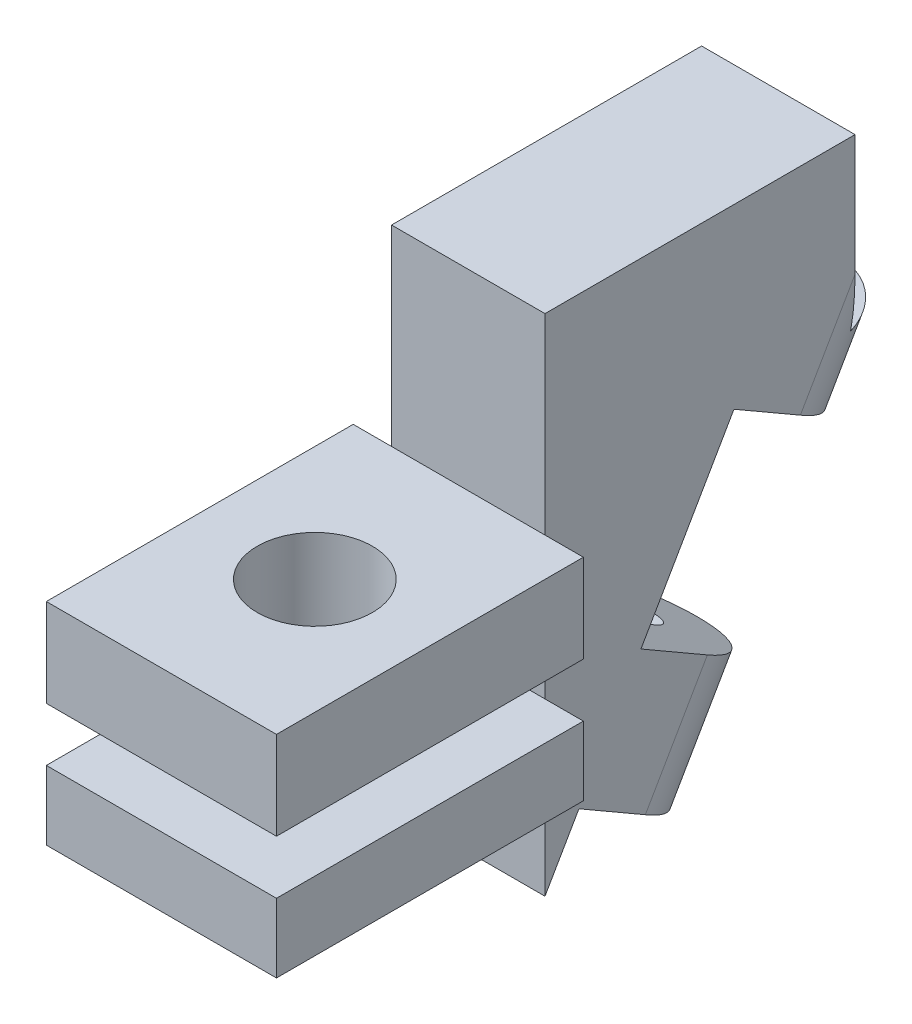
ISO-10303-21;
HEADER;
FILE_DESCRIPTION(('STEP AP214'),'2;1');
FILE_NAME('part.step','',(''),(''),'','','');
FILE_SCHEMA(('AUTOMOTIVE_DESIGN { 1 0 10303 214 1 1 1 1 }'));
ENDSEC;
DATA;
#1=APPLICATION_CONTEXT('core data for automotive mechanical design processes');
#2=APPLICATION_PROTOCOL_DEFINITION('international standard','automotive_design',2000,#1);
#3=PRODUCT_CONTEXT('',#1,'mechanical');
#4=PRODUCT('Part','Part','',(#3));
#5=PRODUCT_RELATED_PRODUCT_CATEGORY('part','',(#4));
#6=PRODUCT_DEFINITION_FORMATION('','',#4);
#7=PRODUCT_DEFINITION_CONTEXT('part definition',#1,'design');
#8=PRODUCT_DEFINITION('design','',#6,#7);
#9=PRODUCT_DEFINITION_SHAPE('','',#8);
#10=(LENGTH_UNIT() NAMED_UNIT(*) SI_UNIT(.MILLI.,.METRE.));
#11=(NAMED_UNIT(*) PLANE_ANGLE_UNIT() SI_UNIT($,.RADIAN.));
#12=(NAMED_UNIT(*) SI_UNIT($,.STERADIAN.) SOLID_ANGLE_UNIT());
#13=UNCERTAINTY_MEASURE_WITH_UNIT(LENGTH_MEASURE(1.E-05),#10,'distance_accuracy_value','');
#14=(GEOMETRIC_REPRESENTATION_CONTEXT(3) GLOBAL_UNCERTAINTY_ASSIGNED_CONTEXT((#13)) GLOBAL_UNIT_ASSIGNED_CONTEXT((#10,
#11,#12)) REPRESENTATION_CONTEXT('',''));
#15=CARTESIAN_POINT('',(0.,0.,0.));
#16=DIRECTION('',(0.,0.,1.));
#17=DIRECTION('',(1.,0.,0.));
#18=AXIS2_PLACEMENT_3D('',#15,#16,#17);
#19=CARTESIAN_POINT('',(3.,-1.,19.0829037686548));
#20=DIRECTION('',(0.,0.,-1.));
#21=DIRECTION('',(-1.,0.,0.));
#22=AXIS2_PLACEMENT_3D('',#19,#20,#21);
#23=PLANE('',#22);
#24=DIRECTION('',(0.,1.,0.));
#25=VECTOR('',#24,1.);
#26=CARTESIAN_POINT('',(-3.,-1.,19.0829037686548));
#27=LINE('',#26,#25);
#28=CARTESIAN_POINT('',(-3.,-1.,19.0829037686548));
#29=VERTEX_POINT('',#28);
#30=CARTESIAN_POINT('',(-3.,0.8,19.0829037686548));
#31=VERTEX_POINT('',#30);
#32=EDGE_CURVE('E318',#29,#31,#27,.T.);
#33=ORIENTED_EDGE('',*,*,#32,.T.);
#34=DIRECTION('',(-1.,0.,0.));
#35=VECTOR('',#34,1.);
#36=CARTESIAN_POINT('',(-3.,0.8,19.0829037686548));
#37=LINE('',#36,#35);
#38=CARTESIAN_POINT('',(-2.,0.8,19.0829037686548));
#39=VERTEX_POINT('',#38);
#40=EDGE_CURVE('E257',#39,#31,#37,.T.);
#41=ORIENTED_EDGE('',*,*,#40,.F.);
#42=DIRECTION('',(0.,1.,0.));
#43=VECTOR('',#42,1.);
#44=CARTESIAN_POINT('',(-2.,9.5,19.0829037686548));
#45=LINE('',#44,#43);
#46=CARTESIAN_POINT('',(-2.,-1.,19.0829037686548));
#47=VERTEX_POINT('',#46);
#48=EDGE_CURVE('E345',#47,#39,#45,.T.);
#49=ORIENTED_EDGE('',*,*,#48,.F.);
#50=DIRECTION('',(-1.,0.,0.));
#51=VECTOR('',#50,1.);
#52=CARTESIAN_POINT('',(3.,-1.,19.0829037686548));
#53=LINE('',#52,#51);
#54=EDGE_CURVE('E312',#47,#29,#53,.T.);
#55=ORIENTED_EDGE('',*,*,#54,.T.);
#56=EDGE_LOOP('',(#33,#41,#49,#55));
#57=FACE_BOUND('',#56,.T.);
#58=ADVANCED_FACE('F35',(#57),#23,.T.);
#59=DIRECTION('',(0.,-1.,0.));
#60=VECTOR('',#59,1.);
#61=CARTESIAN_POINT('',(2.,9.5,19.0829037686548));
#62=LINE('',#61,#60);
#63=CARTESIAN_POINT('',(2.,0.8,19.0829037686548));
#64=VERTEX_POINT('',#63);
#65=CARTESIAN_POINT('',(2.,-1.,19.0829037686548));
#66=VERTEX_POINT('',#65);
#67=EDGE_CURVE('E354',#64,#66,#62,.T.);
#68=ORIENTED_EDGE('',*,*,#67,.F.);
#69=CARTESIAN_POINT('',(3.,0.8,19.0829037686548));
#70=VERTEX_POINT('',#69);
#71=EDGE_CURVE('E258',#70,#64,#37,.T.);
#72=ORIENTED_EDGE('',*,*,#71,.F.);
#73=DIRECTION('',(0.,1.,0.));
#74=VECTOR('',#73,1.);
#75=CARTESIAN_POINT('',(3.,-1.,19.0829037686548));
#76=LINE('',#75,#74);
#77=CARTESIAN_POINT('',(3.,-1.,19.0829037686548));
#78=VERTEX_POINT('',#77);
#79=EDGE_CURVE('E323',#78,#70,#76,.T.);
#80=ORIENTED_EDGE('',*,*,#79,.F.);
#81=EDGE_CURVE('E313',#78,#66,#53,.T.);
#82=ORIENTED_EDGE('',*,*,#81,.T.);
#83=EDGE_LOOP('',(#68,#72,#80,#82));
#84=FACE_BOUND('',#83,.T.);
#85=ADVANCED_FACE('F457',(#84),#23,.T.);
#86=CARTESIAN_POINT('',(-3.,-1.,27.0829037686548));
#87=DIRECTION('',(-1.,0.,0.));
#88=DIRECTION('',(0.,0.,1.));
#89=AXIS2_PLACEMENT_3D('',#86,#87,#88);
#90=PLANE('',#89);
#91=DIRECTION('',(0.,1.,0.));
#92=VECTOR('',#91,1.);
#93=CARTESIAN_POINT('',(-3.,-1.,27.0829037686548));
#94=LINE('',#93,#92);
#95=CARTESIAN_POINT('',(-3.,-1.,27.0829037686548));
#96=VERTEX_POINT('',#95);
#97=CARTESIAN_POINT('',(-3.,0.8,27.0829037686548));
#98=VERTEX_POINT('',#97);
#99=EDGE_CURVE('E331',#96,#98,#94,.T.);
#100=ORIENTED_EDGE('',*,*,#99,.T.);
#101=DIRECTION('',(0.,0.,1.));
#102=VECTOR('',#101,1.);
#103=CARTESIAN_POINT('',(-3.,0.8,19.0829037686548));
#104=LINE('',#103,#102);
#105=EDGE_CURVE('E225',#31,#98,#104,.T.);
#106=ORIENTED_EDGE('',*,*,#105,.F.);
#107=ORIENTED_EDGE('',*,*,#32,.F.);
#108=DIRECTION('',(0.,0.,1.));
#109=VECTOR('',#108,1.);
#110=CARTESIAN_POINT('',(-3.,-1.,27.0829037686548));
#111=LINE('',#110,#109);
#112=EDGE_CURVE('E302',#29,#96,#111,.T.);
#113=ORIENTED_EDGE('',*,*,#112,.T.);
#114=EDGE_LOOP('',(#100,#106,#107,#113));
#115=FACE_BOUND('',#114,.T.);
#116=ADVANCED_FACE('F441',(#115),#90,.T.);
#117=CARTESIAN_POINT('',(3.,-1.,27.0829037686548));
#118=DIRECTION('',(1.,0.,0.));
#119=DIRECTION('',(0.,0.,-1.));
#120=AXIS2_PLACEMENT_3D('',#117,#118,#119);
#121=PLANE('',#120);
#122=ORIENTED_EDGE('',*,*,#79,.T.);
#123=DIRECTION('',(0.,0.,-1.));
#124=VECTOR('',#123,1.);
#125=CARTESIAN_POINT('',(3.,0.8,27.0829037686548));
#126=LINE('',#125,#124);
#127=CARTESIAN_POINT('',(3.,0.8,27.0829037686548));
#128=VERTEX_POINT('',#127);
#129=EDGE_CURVE('E255',#128,#70,#126,.T.);
#130=ORIENTED_EDGE('',*,*,#129,.F.);
#131=DIRECTION('',(0.,1.,0.));
#132=VECTOR('',#131,1.);
#133=CARTESIAN_POINT('',(3.,-1.,27.0829037686548));
#134=LINE('',#133,#132);
#135=CARTESIAN_POINT('',(3.,-1.,27.0829037686548));
#136=VERTEX_POINT('',#135);
#137=EDGE_CURVE('E327',#136,#128,#134,.T.);
#138=ORIENTED_EDGE('',*,*,#137,.F.);
#139=DIRECTION('',(0.,0.,-1.));
#140=VECTOR('',#139,1.);
#141=CARTESIAN_POINT('',(3.,-1.,27.0829037686548));
#142=LINE('',#141,#140);
#143=EDGE_CURVE('E309',#136,#78,#142,.T.);
#144=ORIENTED_EDGE('',*,*,#143,.T.);
#145=EDGE_LOOP('',(#122,#130,#138,#144));
#146=FACE_BOUND('',#145,.T.);
#147=ADVANCED_FACE('F454',(#146),#121,.T.);
#148=CARTESIAN_POINT('',(3.,-1.,27.0829037686548));
#149=DIRECTION('',(0.,0.,1.));
#150=DIRECTION('',(1.,0.,0.));
#151=AXIS2_PLACEMENT_3D('',#148,#149,#150);
#152=PLANE('',#151);
#153=ORIENTED_EDGE('',*,*,#137,.T.);
#154=DIRECTION('',(1.,0.,0.));
#155=VECTOR('',#154,1.);
#156=CARTESIAN_POINT('',(-3.,0.8,27.0829037686548));
#157=LINE('',#156,#155);
#158=EDGE_CURVE('E253',#98,#128,#157,.T.);
#159=ORIENTED_EDGE('',*,*,#158,.F.);
#160=ORIENTED_EDGE('',*,*,#99,.F.);
#161=DIRECTION('',(1.,0.,0.));
#162=VECTOR('',#161,1.);
#163=CARTESIAN_POINT('',(3.,-1.,27.0829037686548));
#164=LINE('',#163,#162);
#165=EDGE_CURVE('E306',#96,#136,#164,.T.);
#166=ORIENTED_EDGE('',*,*,#165,.T.);
#167=EDGE_LOOP('',(#153,#159,#160,#166));
#168=FACE_BOUND('',#167,.T.);
#169=ADVANCED_FACE('F446',(#168),#152,.T.);
#170=CARTESIAN_POINT('',(0.,-6.5,23.0829037686548));
#171=DIRECTION('',(0.,1.,0.));
#172=DIRECTION('',(0.,0.,1.));
#173=AXIS2_PLACEMENT_3D('',#170,#171,#172);
#174=CYLINDRICAL_SURFACE('',#173,1.5);
#175=CARTESIAN_POINT('',(0.,-1.,23.0829037686548));
#176=DIRECTION('',(0.,1.,0.));
#177=DIRECTION('',(0.,0.,1.));
#178=AXIS2_PLACEMENT_3D('',#175,#176,#177);
#179=CIRCLE('',#178,1.5);
#180=CARTESIAN_POINT('',(0.,-1.,24.5829037686548));
#181=VERTEX_POINT('',#180);
#182=EDGE_CURVE('E286',#181,#181,#179,.T.);
#183=ORIENTED_EDGE('',*,*,#182,.F.);
#184=EDGE_LOOP('',(#183));
#185=FACE_BOUND('',#184,.T.);
#186=CARTESIAN_POINT('',(0.,0.8,23.0829037686548));
#187=DIRECTION('',(0.,1.,0.));
#188=DIRECTION('',(0.,0.,1.));
#189=AXIS2_PLACEMENT_3D('',#186,#187,#188);
#190=CIRCLE('',#189,1.5);
#191=CARTESIAN_POINT('',(0.,0.8,24.5829037686548));
#192=VERTEX_POINT('',#191);
#193=EDGE_CURVE('E275',#192,#192,#190,.F.);
#194=ORIENTED_EDGE('',*,*,#193,.F.);
#195=EDGE_LOOP('',(#194));
#196=FACE_BOUND('',#195,.T.);
#197=ADVANCED_FACE('F528',(#185,#196),#174,.F.);
#198=CARTESIAN_POINT('',(19.925772879665,9.5,19.0829037686548));
#199=DIRECTION('',(0.,0.,-1.));
#200=DIRECTION('',(-1.,0.,0.));
#201=AXIS2_PLACEMENT_3D('',#198,#199,#200);
#202=PLANE('',#201);
#203=DIRECTION('',(-1.,0.,0.));
#204=VECTOR('',#203,1.);
#205=CARTESIAN_POINT('',(3.,4.5,19.0829037686548));
#206=LINE('',#205,#204);
#207=CARTESIAN_POINT('',(2.,4.5,19.0829037686548));
#208=VERTEX_POINT('',#207);
#209=CARTESIAN_POINT('',(-2.,4.5,19.0829037686548));
#210=VERTEX_POINT('',#209);
#211=EDGE_CURVE('E303',#208,#210,#206,.T.);
#212=ORIENTED_EDGE('',*,*,#211,.F.);
#213=CARTESIAN_POINT('',(2.,9.5,19.0829037686548));
#214=VERTEX_POINT('',#213);
#215=EDGE_CURVE('E350',#214,#208,#62,.T.);
#216=ORIENTED_EDGE('',*,*,#215,.F.);
#217=DIRECTION('',(-1.,0.,0.));
#218=VECTOR('',#217,1.);
#219=CARTESIAN_POINT('',(19.925772879665,9.5,19.0829037686548));
#220=LINE('',#219,#218);
#221=CARTESIAN_POINT('',(-2.,9.5,19.0829037686548));
#222=VERTEX_POINT('',#221);
#223=EDGE_CURVE('E344',#214,#222,#220,.T.);
#224=ORIENTED_EDGE('',*,*,#223,.T.);
#225=EDGE_CURVE('E341',#210,#222,#45,.T.);
#226=ORIENTED_EDGE('',*,*,#225,.F.);
#227=EDGE_LOOP('',(#212,#216,#224,#226));
#228=FACE_BOUND('',#227,.T.);
#229=ADVANCED_FACE('F469',(#228),#202,.F.);
#230=CARTESIAN_POINT('',(0.,5.,0.));
#231=DIRECTION('',(0.,1.,0.));
#232=DIRECTION('',(0.,0.,1.));
#233=AXIS2_PLACEMENT_3D('',#230,#231,#232);
#234=PLANE('',#233);
#235=CARTESIAN_POINT('',(0.,5.,11.7767090063074));
#236=DIRECTION('',(0.,1.,0.));
#237=DIRECTION('',(0.,0.,-1.));
#238=AXIS2_PLACEMENT_3D('',#235,#236,#237);
#239=ELLIPSE('',#238,2.3094010767585,2.);
#240=CARTESIAN_POINT('',(1.88349205988257,5.,11.));
#241=VERTEX_POINT('',#240);
#242=CARTESIAN_POINT('',(0.,5.,9.46730792954894));
#243=VERTEX_POINT('',#242);
#244=EDGE_CURVE('E388',#241,#243,#239,.T.);
#245=ORIENTED_EDGE('',*,*,#244,.T.);
#246=CARTESIAN_POINT('',(0.,5.,11.7767090063074));
#247=DIRECTION('',(0.,1.,0.));
#248=DIRECTION('',(0.,0.,1.));
#249=AXIS2_PLACEMENT_3D('',#246,#247,#248);
#250=ELLIPSE('',#249,2.3094010767585,2.);
#251=CARTESIAN_POINT('',(-1.88349205988257,5.,11.));
#252=VERTEX_POINT('',#251);
#253=EDGE_CURVE('E390',#243,#252,#250,.T.);
#254=ORIENTED_EDGE('',*,*,#253,.T.);
#255=DIRECTION('',(1.,0.,0.));
#256=VECTOR('',#255,1.);
#257=CARTESIAN_POINT('',(-2.,5.,11.));
#258=LINE('',#257,#256);
#259=EDGE_CURVE('E349',#252,#241,#258,.T.);
#260=ORIENTED_EDGE('',*,*,#259,.T.);
#261=EDGE_LOOP('',(#245,#254,#260));
#262=FACE_BOUND('',#261,.T.);
#263=ADVANCED_FACE('F642',(#262),#234,.T.);
#264=CARTESIAN_POINT('',(-2.,0.,0.));
#265=DIRECTION('',(1.,0.,0.));
#266=DIRECTION('',(0.,0.,-1.));
#267=AXIS2_PLACEMENT_3D('',#264,#265,#266);
#268=PLANE('',#267);
#269=DIRECTION('',(0.,-1.,0.));
#270=VECTOR('',#269,1.);
#271=CARTESIAN_POINT('',(-2.,9.5,11.));
#272=LINE('',#271,#270);
#273=CARTESIAN_POINT('',(-2.,9.5,11.));
#274=VERTEX_POINT('',#273);
#275=CARTESIAN_POINT('',(-2.,6.34529946162084,11.));
#276=VERTEX_POINT('',#275);
#277=EDGE_CURVE('E336',#274,#276,#272,.T.);
#278=ORIENTED_EDGE('',*,*,#277,.T.);
#279=DIRECTION('',(0.,-0.86602540378444,0.499999999999998));
#280=VECTOR('',#279,1.);
#281=CARTESIAN_POINT('',(-2.,6.3494645862196,10.9975952641917));
#282=LINE('',#281,#280);
#283=CARTESIAN_POINT('',(-2.,3.8773502691896,12.4248711305965));
#284=VERTEX_POINT('',#283);
#285=EDGE_CURVE('E211',#276,#284,#282,.T.);
#286=ORIENTED_EDGE('',*,*,#285,.T.);
#287=DIRECTION('',(0.,0.499999999999997,0.86602540378444));
#288=VECTOR('',#287,1.);
#289=CARTESIAN_POINT('',(-2.,-2.47211431702999,1.42727586640478));
#290=LINE('',#289,#288);
#291=CARTESIAN_POINT('',(-2.,4.87735026918959,14.1569219381654));
#292=VERTEX_POINT('',#291);
#293=EDGE_CURVE('E204',#284,#292,#290,.T.);
#294=ORIENTED_EDGE('',*,*,#293,.T.);
#295=DIRECTION('',(0.,-0.86602540378444,0.499999999999997));
#296=VECTOR('',#295,1.);
#297=CARTESIAN_POINT('',(-2.,7.34946458621958,12.7296460717606));
#298=LINE('',#297,#296);
#299=CARTESIAN_POINT('',(-2.,0.677350269189582,16.5817930687618));
#300=VERTEX_POINT('',#299);
#301=EDGE_CURVE('E209',#292,#300,#298,.T.);
#302=ORIENTED_EDGE('',*,*,#301,.T.);
#303=DIRECTION('',(0.,-0.499999999999997,-0.86602540378444));
#304=VECTOR('',#303,1.);
#305=CARTESIAN_POINT('',(-2.,-6.67211431703,3.8521469970012));
#306=LINE('',#305,#304);
#307=CARTESIAN_POINT('',(-2.,-0.322649730810414,14.8497422611929));
#308=VERTEX_POINT('',#307);
#309=EDGE_CURVE('E241',#300,#308,#306,.T.);
#310=ORIENTED_EDGE('',*,*,#309,.T.);
#311=DIRECTION('',(0.,-0.866025403784441,0.499999999999996));
#312=VECTOR('',#311,1.);
#313=CARTESIAN_POINT('',(-2.,6.34946458621958,10.9975952641917));
#314=LINE('',#313,#312);
#315=CARTESIAN_POINT('',(-2.,-3.12264973081043,16.4663230149238));
#316=VERTEX_POINT('',#315);
#317=EDGE_CURVE('E380',#308,#316,#314,.T.);
#318=ORIENTED_EDGE('',*,*,#317,.T.);
#319=DIRECTION('',(0.,0.499999999999998,0.86602540378444));
#320=VECTOR('',#319,1.);
#321=CARTESIAN_POINT('',(-2.,-9.47211431703002,5.46872775073216));
#322=LINE('',#321,#320);
#323=CARTESIAN_POINT('',(-2.,-2.12264973081043,18.1983738224927));
#324=VERTEX_POINT('',#323);
#325=EDGE_CURVE('E246',#316,#324,#322,.T.);
#326=ORIENTED_EDGE('',*,*,#325,.T.);
#327=DIRECTION('',(0.,-0.866025403784441,0.499999999999997));
#328=VECTOR('',#327,1.);
#329=CARTESIAN_POINT('',(-2.,7.34946458621958,12.7296460717606));
#330=LINE('',#329,#328);
#331=CARTESIAN_POINT('',(-2.,-3.65470053837923,19.0829037686548));
#332=VERTEX_POINT('',#331);
#333=EDGE_CURVE('E226',#324,#332,#330,.T.);
#334=ORIENTED_EDGE('',*,*,#333,.T.);
#335=EDGE_CURVE('E342',#332,#47,#45,.T.);
#336=ORIENTED_EDGE('',*,*,#335,.T.);
#337=ORIENTED_EDGE('',*,*,#48,.T.);
#338=DIRECTION('',(0.,-1.,0.));
#339=VECTOR('',#338,1.);
#340=CARTESIAN_POINT('',(-2.,0.,19.0829037686548));
#341=LINE('',#340,#339);
#342=CARTESIAN_POINT('',(-2.,2.2,19.0829037686548));
#343=VERTEX_POINT('',#342);
#344=EDGE_CURVE('E280',#343,#39,#341,.T.);
#345=ORIENTED_EDGE('',*,*,#344,.F.);
#346=EDGE_CURVE('E346',#343,#210,#45,.T.);
#347=ORIENTED_EDGE('',*,*,#346,.T.);
#348=ORIENTED_EDGE('',*,*,#225,.T.);
#349=DIRECTION('',(0.,0.,-1.));
#350=VECTOR('',#349,1.);
#351=CARTESIAN_POINT('',(-2.,9.5,19.0829037686548));
#352=LINE('',#351,#350);
#353=EDGE_CURVE('E338',#222,#274,#352,.T.);
#354=ORIENTED_EDGE('',*,*,#353,.T.);
#355=EDGE_LOOP('',(#278,#286,#294,#302,#310,#318,#326,#334,#336,#337,#345,#347,#348,#354));
#356=FACE_BOUND('',#355,.T.);
#357=ADVANCED_FACE('F207',(#356),#268,.F.);
#358=CARTESIAN_POINT('',(2.,0.,0.));
#359=DIRECTION('',(1.,0.,0.));
#360=DIRECTION('',(0.,0.,-1.));
#361=AXIS2_PLACEMENT_3D('',#358,#359,#360);
#362=PLANE('',#361);
#363=DIRECTION('',(0.,0.499999999999997,0.86602540378444));
#364=VECTOR('',#363,1.);
#365=CARTESIAN_POINT('',(2.,-2.47211431702999,1.42727586640478));
#366=LINE('',#365,#364);
#367=CARTESIAN_POINT('',(2.,3.87735026918959,12.4248711305965));
#368=VERTEX_POINT('',#367);
#369=CARTESIAN_POINT('',(2.,4.87735026918959,14.1569219381654));
#370=VERTEX_POINT('',#369);
#371=EDGE_CURVE('E215',#368,#370,#366,.T.);
#372=ORIENTED_EDGE('',*,*,#371,.F.);
#373=DIRECTION('',(0.,-0.86602540378444,0.499999999999998));
#374=VECTOR('',#373,1.);
#375=CARTESIAN_POINT('',(2.,6.,11.1993587371178));
#376=LINE('',#375,#374);
#377=CARTESIAN_POINT('',(2.,6.34529946162084,11.));
#378=VERTEX_POINT('',#377);
#379=EDGE_CURVE('E398',#368,#378,#376,.F.);
#380=ORIENTED_EDGE('',*,*,#379,.T.);
#381=DIRECTION('',(0.,1.,0.));
#382=VECTOR('',#381,1.);
#383=CARTESIAN_POINT('',(2.,9.5,11.));
#384=LINE('',#383,#382);
#385=CARTESIAN_POINT('',(2.,9.5,11.));
#386=VERTEX_POINT('',#385);
#387=EDGE_CURVE('E347',#378,#386,#384,.T.);
#388=ORIENTED_EDGE('',*,*,#387,.T.);
#389=DIRECTION('',(0.,0.,1.));
#390=VECTOR('',#389,1.);
#391=CARTESIAN_POINT('',(2.,9.5,19.0829037686548));
#392=LINE('',#391,#390);
#393=EDGE_CURVE('E355',#386,#214,#392,.T.);
#394=ORIENTED_EDGE('',*,*,#393,.T.);
#395=ORIENTED_EDGE('',*,*,#215,.T.);
#396=CARTESIAN_POINT('',(2.,2.2,19.0829037686548));
#397=VERTEX_POINT('',#396);
#398=EDGE_CURVE('E353',#208,#397,#62,.T.);
#399=ORIENTED_EDGE('',*,*,#398,.T.);
#400=DIRECTION('',(0.,-1.,0.));
#401=VECTOR('',#400,1.);
#402=CARTESIAN_POINT('',(2.,0.,19.0829037686548));
#403=LINE('',#402,#401);
#404=EDGE_CURVE('E277',#397,#64,#403,.T.);
#405=ORIENTED_EDGE('',*,*,#404,.T.);
#406=ORIENTED_EDGE('',*,*,#67,.T.);
#407=CARTESIAN_POINT('',(2.,-3.65470053837923,19.0829037686548));
#408=VERTEX_POINT('',#407);
#409=EDGE_CURVE('E358',#66,#408,#62,.T.);
#410=ORIENTED_EDGE('',*,*,#409,.T.);
#411=DIRECTION('',(0.,-0.866025403784441,0.499999999999997));
#412=VECTOR('',#411,1.);
#413=CARTESIAN_POINT('',(2.,7.34946458621958,12.7296460717606));
#414=LINE('',#413,#412);
#415=CARTESIAN_POINT('',(2.,-2.12264973081043,18.1983738224927));
#416=VERTEX_POINT('',#415);
#417=EDGE_CURVE('E248',#416,#408,#414,.T.);
#418=ORIENTED_EDGE('',*,*,#417,.F.);
#419=DIRECTION('',(0.,0.499999999999998,0.86602540378444));
#420=VECTOR('',#419,1.);
#421=CARTESIAN_POINT('',(2.,-9.47211431703002,5.46872775073216));
#422=LINE('',#421,#420);
#423=CARTESIAN_POINT('',(2.,-3.12264973081043,16.4663230149238));
#424=VERTEX_POINT('',#423);
#425=EDGE_CURVE('E244',#424,#416,#422,.T.);
#426=ORIENTED_EDGE('',*,*,#425,.F.);
#427=DIRECTION('',(0.,-0.866025403784441,0.499999999999996));
#428=VECTOR('',#427,1.);
#429=CARTESIAN_POINT('',(2.,-0.322649730810416,14.8497422611929));
#430=LINE('',#429,#428);
#431=CARTESIAN_POINT('',(2.,-0.322649730810413,14.8497422611929));
#432=VERTEX_POINT('',#431);
#433=EDGE_CURVE('E396',#424,#432,#430,.F.);
#434=ORIENTED_EDGE('',*,*,#433,.T.);
#435=DIRECTION('',(0.,-0.499999999999997,-0.86602540378444));
#436=VECTOR('',#435,1.);
#437=CARTESIAN_POINT('',(2.,-6.67211431703,3.8521469970012));
#438=LINE('',#437,#436);
#439=CARTESIAN_POINT('',(2.,0.677350269189582,16.5817930687618));
#440=VERTEX_POINT('',#439);
#441=EDGE_CURVE('E239',#440,#432,#438,.T.);
#442=ORIENTED_EDGE('',*,*,#441,.F.);
#443=DIRECTION('',(0.,-0.86602540378444,0.499999999999997));
#444=VECTOR('',#443,1.);
#445=CARTESIAN_POINT('',(2.,7.34946458621958,12.7296460717606));
#446=LINE('',#445,#444);
#447=EDGE_CURVE('E378',#370,#440,#446,.T.);
#448=ORIENTED_EDGE('',*,*,#447,.F.);
#449=EDGE_LOOP('',(#372,#380,#388,#394,#395,#399,#405,#406,#410,#418,#426,#434,#442,#448));
#450=FACE_BOUND('',#449,.T.);
#451=ADVANCED_FACE('F412',(#450),#362,.T.);
#452=ORIENTED_EDGE('',*,*,#335,.F.);
#453=DIRECTION('',(1.,0.,0.));
#454=VECTOR('',#453,1.);
#455=CARTESIAN_POINT('',(19.925772879665,-3.65470053837923,19.0829037686548));
#456=LINE('',#455,#454);
#457=EDGE_CURVE('E375',#332,#408,#456,.T.);
#458=ORIENTED_EDGE('',*,*,#457,.T.);
#459=ORIENTED_EDGE('',*,*,#409,.F.);
#460=EDGE_CURVE('E317',#66,#47,#53,.T.);
#461=ORIENTED_EDGE('',*,*,#460,.T.);
#462=EDGE_LOOP('',(#452,#458,#459,#461));
#463=FACE_BOUND('',#462,.T.);
#464=ADVANCED_FACE('F428',(#463),#202,.F.);
#465=CARTESIAN_POINT('',(19.925772879665,9.5,11.));
#466=DIRECTION('',(0.,0.,1.));
#467=DIRECTION('',(1.,0.,0.));
#468=AXIS2_PLACEMENT_3D('',#465,#466,#467);
#469=PLANE('',#468);
#470=CARTESIAN_POINT('',(0.,6.34529946162083,11.));
#471=DIRECTION('',(0.,0.,1.));
#472=DIRECTION('',(0.,-1.,0.));
#473=AXIS2_PLACEMENT_3D('',#470,#471,#472);
#474=ELLIPSE('',#473,1.3,0.649999999999999);
#475=CARTESIAN_POINT('',(0.,5.04529946162082,11.));
#476=VERTEX_POINT('',#475);
#477=EDGE_CURVE('E321',#476,#476,#474,.T.);
#478=ORIENTED_EDGE('',*,*,#477,.T.);
#479=EDGE_LOOP('',(#478));
#480=FACE_BOUND('',#479,.T.);
#481=ORIENTED_EDGE('',*,*,#259,.F.);
#482=CARTESIAN_POINT('',(0.,6.34529946162084,11.));
#483=DIRECTION('',(0.,0.,1.));
#484=DIRECTION('',(0.,-1.,0.));
#485=AXIS2_PLACEMENT_3D('',#482,#483,#484);
#486=ELLIPSE('',#485,4.00000000000001,2.);
#487=EDGE_CURVE('E394',#252,#276,#486,.F.);
#488=ORIENTED_EDGE('',*,*,#487,.T.);
#489=ORIENTED_EDGE('',*,*,#277,.F.);
#490=DIRECTION('',(-1.,0.,0.));
#491=VECTOR('',#490,1.);
#492=CARTESIAN_POINT('',(19.925772879665,9.5,11.));
#493=LINE('',#492,#491);
#494=EDGE_CURVE('E359',#386,#274,#493,.T.);
#495=ORIENTED_EDGE('',*,*,#494,.F.);
#496=ORIENTED_EDGE('',*,*,#387,.F.);
#497=CARTESIAN_POINT('',(0.,6.34529946162083,11.));
#498=DIRECTION('',(0.,0.,1.));
#499=DIRECTION('',(0.,1.,0.));
#500=AXIS2_PLACEMENT_3D('',#497,#498,#499);
#501=ELLIPSE('',#500,4.00000000000001,2.);
#502=EDGE_CURVE('E392',#378,#241,#501,.F.);
#503=ORIENTED_EDGE('',*,*,#502,.T.);
#504=EDGE_LOOP('',(#481,#488,#489,#495,#496,#503));
#505=FACE_BOUND('',#504,.T.);
#506=ADVANCED_FACE('F477',(#480,#505),#469,.F.);
#507=CARTESIAN_POINT('',(19.925772879665,9.5,19.0829037686548));
#508=DIRECTION('',(0.,-1.,0.));
#509=DIRECTION('',(0.,0.,-1.));
#510=AXIS2_PLACEMENT_3D('',#507,#508,#509);
#511=PLANE('',#510);
#512=ORIENTED_EDGE('',*,*,#393,.F.);
#513=ORIENTED_EDGE('',*,*,#494,.T.);
#514=ORIENTED_EDGE('',*,*,#353,.F.);
#515=ORIENTED_EDGE('',*,*,#223,.F.);
#516=EDGE_LOOP('',(#512,#513,#514,#515));
#517=FACE_BOUND('',#516,.T.);
#518=ADVANCED_FACE('F472',(#517),#511,.F.);
#519=CARTESIAN_POINT('',(0.,16.0725407975729,5.38397459621564));
#520=DIRECTION('',(0.,-0.86602540378444,0.499999999999998));
#521=DIRECTION('',(0.,-0.499999999999998,-0.86602540378444));
#522=AXIS2_PLACEMENT_3D('',#519,#520,#521);
#523=CYLINDRICAL_SURFACE('',#522,0.649999999999999);
#524=CARTESIAN_POINT('',(0.,3.87735026918959,12.4248711305965));
#525=DIRECTION('',(0.,0.86602540378444,-0.499999999999997));
#526=DIRECTION('',(0.,0.499999999999997,0.86602540378444));
#527=AXIS2_PLACEMENT_3D('',#524,#525,#526);
#528=CIRCLE('',#527,0.649999999999999);
#529=CARTESIAN_POINT('',(0.,4.20235026918959,12.9877876430564));
#530=VERTEX_POINT('',#529);
#531=EDGE_CURVE('E237',#530,#530,#528,.F.);
#532=ORIENTED_EDGE('',*,*,#531,.T.);
#533=EDGE_LOOP('',(#532));
#534=FACE_BOUND('',#533,.T.);
#535=ORIENTED_EDGE('',*,*,#477,.F.);
#536=EDGE_LOOP('',(#535));
#537=FACE_BOUND('',#536,.T.);
#538=ADVANCED_FACE('F537',(#534,#537),#523,.F.);
#539=DIRECTION('',(-1.,0.,0.));
#540=VECTOR('',#539,1.);
#541=CARTESIAN_POINT('',(-3.,2.2,19.0829037686548));
#542=LINE('',#541,#540);
#543=CARTESIAN_POINT('',(-3.,2.2,19.0829037686548));
#544=VERTEX_POINT('',#543);
#545=EDGE_CURVE('E271',#343,#544,#542,.T.);
#546=ORIENTED_EDGE('',*,*,#545,.T.);
#547=CARTESIAN_POINT('',(-3.,4.5,19.0829037686548));
#548=VERTEX_POINT('',#547);
#549=EDGE_CURVE('E322',#544,#548,#27,.T.);
#550=ORIENTED_EDGE('',*,*,#549,.T.);
#551=EDGE_CURVE('E298',#210,#548,#206,.T.);
#552=ORIENTED_EDGE('',*,*,#551,.F.);
#553=ORIENTED_EDGE('',*,*,#346,.F.);
#554=EDGE_LOOP('',(#546,#550,#552,#553));
#555=FACE_BOUND('',#554,.T.);
#556=ADVANCED_FACE('F516',(#555),#23,.T.);
#557=CARTESIAN_POINT('',(3.,2.2,19.0829037686548));
#558=VERTEX_POINT('',#557);
#559=EDGE_CURVE('E272',#558,#397,#542,.T.);
#560=ORIENTED_EDGE('',*,*,#559,.T.);
#561=ORIENTED_EDGE('',*,*,#398,.F.);
#562=CARTESIAN_POINT('',(3.,4.5,19.0829037686548));
#563=VERTEX_POINT('',#562);
#564=EDGE_CURVE('E299',#563,#208,#206,.T.);
#565=ORIENTED_EDGE('',*,*,#564,.F.);
#566=EDGE_CURVE('E326',#558,#563,#76,.T.);
#567=ORIENTED_EDGE('',*,*,#566,.F.);
#568=EDGE_LOOP('',(#560,#561,#565,#567));
#569=FACE_BOUND('',#568,.T.);
#570=ADVANCED_FACE('F492',(#569),#23,.T.);
#571=DIRECTION('',(0.,0.,1.));
#572=VECTOR('',#571,1.);
#573=CARTESIAN_POINT('',(-3.,2.2,19.0829037686548));
#574=LINE('',#573,#572);
#575=CARTESIAN_POINT('',(-3.,2.2,27.0829037686548));
#576=VERTEX_POINT('',#575);
#577=EDGE_CURVE('E261',#544,#576,#574,.T.);
#578=ORIENTED_EDGE('',*,*,#577,.T.);
#579=CARTESIAN_POINT('',(-3.,4.5,27.0829037686548));
#580=VERTEX_POINT('',#579);
#581=EDGE_CURVE('E316',#576,#580,#94,.T.);
#582=ORIENTED_EDGE('',*,*,#581,.T.);
#583=DIRECTION('',(0.,0.,1.));
#584=VECTOR('',#583,1.);
#585=CARTESIAN_POINT('',(-3.,4.5,27.0829037686548));
#586=LINE('',#585,#584);
#587=EDGE_CURVE('E289',#548,#580,#586,.T.);
#588=ORIENTED_EDGE('',*,*,#587,.F.);
#589=ORIENTED_EDGE('',*,*,#549,.F.);
#590=EDGE_LOOP('',(#578,#582,#588,#589));
#591=FACE_BOUND('',#590,.T.);
#592=ADVANCED_FACE('F511',(#591),#90,.T.);
#593=DIRECTION('',(0.,0.,-1.));
#594=VECTOR('',#593,1.);
#595=CARTESIAN_POINT('',(3.,2.2,27.0829037686548));
#596=LINE('',#595,#594);
#597=CARTESIAN_POINT('',(3.,2.2,27.0829037686548));
#598=VERTEX_POINT('',#597);
#599=EDGE_CURVE('E268',#598,#558,#596,.T.);
#600=ORIENTED_EDGE('',*,*,#599,.T.);
#601=ORIENTED_EDGE('',*,*,#566,.T.);
#602=DIRECTION('',(0.,0.,-1.));
#603=VECTOR('',#602,1.);
#604=CARTESIAN_POINT('',(3.,4.5,27.0829037686548));
#605=LINE('',#604,#603);
#606=CARTESIAN_POINT('',(3.,4.5,27.0829037686548));
#607=VERTEX_POINT('',#606);
#608=EDGE_CURVE('E295',#607,#563,#605,.T.);
#609=ORIENTED_EDGE('',*,*,#608,.F.);
#610=EDGE_CURVE('E330',#598,#607,#134,.T.);
#611=ORIENTED_EDGE('',*,*,#610,.F.);
#612=EDGE_LOOP('',(#600,#601,#609,#611));
#613=FACE_BOUND('',#612,.T.);
#614=ADVANCED_FACE('F501',(#613),#121,.T.);
#615=DIRECTION('',(1.,0.,0.));
#616=VECTOR('',#615,1.);
#617=CARTESIAN_POINT('',(-3.,2.2,27.0829037686548));
#618=LINE('',#617,#616);
#619=EDGE_CURVE('E265',#576,#598,#618,.T.);
#620=ORIENTED_EDGE('',*,*,#619,.T.);
#621=ORIENTED_EDGE('',*,*,#610,.T.);
#622=DIRECTION('',(1.,0.,0.));
#623=VECTOR('',#622,1.);
#624=CARTESIAN_POINT('',(3.,4.5,27.0829037686548));
#625=LINE('',#624,#623);
#626=EDGE_CURVE('E292',#580,#607,#625,.T.);
#627=ORIENTED_EDGE('',*,*,#626,.F.);
#628=ORIENTED_EDGE('',*,*,#581,.F.);
#629=EDGE_LOOP('',(#620,#621,#627,#628));
#630=FACE_BOUND('',#629,.T.);
#631=ADVANCED_FACE('F508',(#630),#152,.T.);
#632=CARTESIAN_POINT('',(0.,-1.,0.));
#633=DIRECTION('',(0.,1.,0.));
#634=DIRECTION('',(0.,0.,1.));
#635=AXIS2_PLACEMENT_3D('',#632,#633,#634);
#636=PLANE('',#635);
#637=ORIENTED_EDGE('',*,*,#182,.T.);
#638=EDGE_LOOP('',(#637));
#639=FACE_BOUND('',#638,.T.);
#640=ORIENTED_EDGE('',*,*,#112,.F.);
#641=ORIENTED_EDGE('',*,*,#54,.F.);
#642=ORIENTED_EDGE('',*,*,#460,.F.);
#643=ORIENTED_EDGE('',*,*,#81,.F.);
#644=ORIENTED_EDGE('',*,*,#143,.F.);
#645=ORIENTED_EDGE('',*,*,#165,.F.);
#646=EDGE_LOOP('',(#640,#641,#642,#643,#644,#645));
#647=FACE_BOUND('',#646,.T.);
#648=ADVANCED_FACE('F443',(#639,#647),#636,.F.);
#649=CARTESIAN_POINT('',(0.,4.5,0.));
#650=DIRECTION('',(0.,1.,0.));
#651=DIRECTION('',(0.,0.,1.));
#652=AXIS2_PLACEMENT_3D('',#649,#650,#651);
#653=PLANE('',#652);
#654=CARTESIAN_POINT('',(0.,4.5,23.0829037686548));
#655=DIRECTION('',(0.,1.,0.));
#656=DIRECTION('',(0.,0.,1.));
#657=AXIS2_PLACEMENT_3D('',#654,#655,#656);
#658=CIRCLE('',#657,1.5);
#659=CARTESIAN_POINT('',(0.,4.5,24.5829037686548));
#660=VERTEX_POINT('',#659);
#661=EDGE_CURVE('E283',#660,#660,#658,.T.);
#662=ORIENTED_EDGE('',*,*,#661,.F.);
#663=EDGE_LOOP('',(#662));
#664=FACE_BOUND('',#663,.T.);
#665=ORIENTED_EDGE('',*,*,#587,.T.);
#666=ORIENTED_EDGE('',*,*,#626,.T.);
#667=ORIENTED_EDGE('',*,*,#608,.T.);
#668=ORIENTED_EDGE('',*,*,#564,.T.);
#669=ORIENTED_EDGE('',*,*,#211,.T.);
#670=ORIENTED_EDGE('',*,*,#551,.T.);
#671=EDGE_LOOP('',(#665,#666,#667,#668,#669,#670));
#672=FACE_BOUND('',#671,.T.);
#673=ADVANCED_FACE('F495',(#664,#672),#653,.T.);
#674=CARTESIAN_POINT('',(0.,2.2,23.0829037686548));
#675=DIRECTION('',(0.,1.,0.));
#676=DIRECTION('',(0.,0.,1.));
#677=AXIS2_PLACEMENT_3D('',#674,#675,#676);
#678=CIRCLE('',#677,1.5);
#679=CARTESIAN_POINT('',(0.,2.2,24.5829037686548));
#680=VERTEX_POINT('',#679);
#681=EDGE_CURVE('E281',#680,#680,#678,.F.);
#682=ORIENTED_EDGE('',*,*,#681,.T.);
#683=EDGE_LOOP('',(#682));
#684=FACE_BOUND('',#683,.T.);
#685=ORIENTED_EDGE('',*,*,#661,.T.);
#686=EDGE_LOOP('',(#685));
#687=FACE_BOUND('',#686,.T.);
#688=ADVANCED_FACE('F519',(#684,#687),#174,.F.);
#689=CARTESIAN_POINT('',(-3.,2.2,19.0829037686548));
#690=DIRECTION('',(0.,0.,1.));
#691=DIRECTION('',(1.,0.,0.));
#692=AXIS2_PLACEMENT_3D('',#689,#690,#691);
#693=PLANE('',#692);
#694=ORIENTED_EDGE('',*,*,#344,.T.);
#695=EDGE_CURVE('E262',#64,#39,#37,.T.);
#696=ORIENTED_EDGE('',*,*,#695,.F.);
#697=ORIENTED_EDGE('',*,*,#404,.F.);
#698=EDGE_CURVE('E276',#397,#343,#542,.T.);
#699=ORIENTED_EDGE('',*,*,#698,.T.);
#700=EDGE_LOOP('',(#694,#696,#697,#699));
#701=FACE_BOUND('',#700,.T.);
#702=ADVANCED_FACE('F517',(#701),#693,.T.);
#703=CARTESIAN_POINT('',(0.,2.2,0.));
#704=DIRECTION('',(0.,1.,0.));
#705=DIRECTION('',(0.,0.,1.));
#706=AXIS2_PLACEMENT_3D('',#703,#704,#705);
#707=PLANE('',#706);
#708=ORIENTED_EDGE('',*,*,#577,.F.);
#709=ORIENTED_EDGE('',*,*,#545,.F.);
#710=ORIENTED_EDGE('',*,*,#698,.F.);
#711=ORIENTED_EDGE('',*,*,#559,.F.);
#712=ORIENTED_EDGE('',*,*,#599,.F.);
#713=ORIENTED_EDGE('',*,*,#619,.F.);
#714=EDGE_LOOP('',(#708,#709,#710,#711,#712,#713));
#715=FACE_BOUND('',#714,.T.);
#716=ORIENTED_EDGE('',*,*,#681,.F.);
#717=EDGE_LOOP('',(#716));
#718=FACE_BOUND('',#717,.T.);
#719=ADVANCED_FACE('F503',(#715,#718),#707,.F.);
#720=CARTESIAN_POINT('',(0.,0.8,0.));
#721=DIRECTION('',(0.,1.,0.));
#722=DIRECTION('',(0.,0.,1.));
#723=AXIS2_PLACEMENT_3D('',#720,#721,#722);
#724=PLANE('',#723);
#725=ORIENTED_EDGE('',*,*,#105,.T.);
#726=ORIENTED_EDGE('',*,*,#158,.T.);
#727=ORIENTED_EDGE('',*,*,#129,.T.);
#728=ORIENTED_EDGE('',*,*,#71,.T.);
#729=ORIENTED_EDGE('',*,*,#695,.T.);
#730=ORIENTED_EDGE('',*,*,#40,.T.);
#731=EDGE_LOOP('',(#725,#726,#727,#728,#729,#730));
#732=FACE_BOUND('',#731,.T.);
#733=ORIENTED_EDGE('',*,*,#193,.T.);
#734=EDGE_LOOP('',(#733));
#735=FACE_BOUND('',#734,.T.);
#736=ADVANCED_FACE('F450',(#732,#735),#724,.T.);
#737=CARTESIAN_POINT('',(-6.,4.87735026918959,14.1569219381654));
#738=DIRECTION('',(0.,0.499999999999997,0.86602540378444));
#739=DIRECTION('',(0.,-0.86602540378444,0.499999999999997));
#740=AXIS2_PLACEMENT_3D('',#737,#738,#739);
#741=PLANE('',#740);
#742=DIRECTION('',(1.,0.,0.));
#743=VECTOR('',#742,1.);
#744=CARTESIAN_POINT('',(-6.,4.87735026918959,14.1569219381654));
#745=LINE('',#744,#743);
#746=EDGE_CURVE('E221',#292,#370,#745,.T.);
#747=ORIENTED_EDGE('',*,*,#746,.T.);
#748=ORIENTED_EDGE('',*,*,#447,.T.);
#749=DIRECTION('',(1.,0.,0.));
#750=VECTOR('',#749,1.);
#751=CARTESIAN_POINT('',(-6.,0.677350269189582,16.5817930687618));
#752=LINE('',#751,#750);
#753=EDGE_CURVE('E224',#300,#440,#752,.T.);
#754=ORIENTED_EDGE('',*,*,#753,.F.);
#755=ORIENTED_EDGE('',*,*,#301,.F.);
#756=EDGE_LOOP('',(#747,#748,#754,#755));
#757=FACE_BOUND('',#756,.T.);
#758=ADVANCED_FACE('F220',(#757),#741,.F.);
#759=CARTESIAN_POINT('',(-6.,-2.12264973081043,18.1983738224927));
#760=DIRECTION('',(0.,0.499999999999997,0.866025403784441));
#761=DIRECTION('',(0.,-0.866025403784441,0.499999999999997));
#762=AXIS2_PLACEMENT_3D('',#759,#760,#761);
#763=PLANE('',#762);
#764=DIRECTION('',(1.,0.,0.));
#765=VECTOR('',#764,1.);
#766=CARTESIAN_POINT('',(-6.,-2.12264973081043,18.1983738224927));
#767=LINE('',#766,#765);
#768=EDGE_CURVE('E232',#324,#416,#767,.T.);
#769=ORIENTED_EDGE('',*,*,#768,.T.);
#770=ORIENTED_EDGE('',*,*,#417,.T.);
#771=ORIENTED_EDGE('',*,*,#457,.F.);
#772=ORIENTED_EDGE('',*,*,#333,.F.);
#773=EDGE_LOOP('',(#769,#770,#771,#772));
#774=FACE_BOUND('',#773,.T.);
#775=ADVANCED_FACE('F422',(#774),#763,.F.);
#776=CARTESIAN_POINT('',(-6.,-4.12264973081043,14.734272207355));
#777=DIRECTION('',(0.,0.86602540378444,-0.499999999999998));
#778=DIRECTION('',(0.,0.499999999999998,0.86602540378444));
#779=AXIS2_PLACEMENT_3D('',#776,#777,#778);
#780=PLANE('',#779);
#781=CARTESIAN_POINT('',(0.,-3.12264973081042,16.4663230149239));
#782=DIRECTION('',(0.,0.86602540378444,-0.499999999999998));
#783=DIRECTION('',(0.,0.499999999999998,0.86602540378444));
#784=AXIS2_PLACEMENT_3D('',#781,#782,#783);
#785=CIRCLE('',#784,0.649999999999999);
#786=CARTESIAN_POINT('',(0.,-2.79764973081043,17.0292395273837));
#787=VERTEX_POINT('',#786);
#788=EDGE_CURVE('E243',#787,#787,#785,.F.);
#789=ORIENTED_EDGE('',*,*,#788,.F.);
#790=EDGE_LOOP('',(#789));
#791=FACE_BOUND('',#790,.T.);
#792=ORIENTED_EDGE('',*,*,#325,.F.);
#793=CARTESIAN_POINT('',(0.,-3.12264973081043,16.4663230149238));
#794=DIRECTION('',(0.,0.86602540378444,-0.499999999999998));
#795=DIRECTION('',(0.,0.499999999999998,0.86602540378444));
#796=AXIS2_PLACEMENT_3D('',#793,#794,#795);
#797=CIRCLE('',#796,2.);
#798=CARTESIAN_POINT('',(0.,-4.12264973081043,14.734272207355));
#799=VERTEX_POINT('',#798);
#800=EDGE_CURVE('E58',#316,#799,#797,.F.);
#801=ORIENTED_EDGE('',*,*,#800,.T.);
#802=CARTESIAN_POINT('',(0.,-3.12264973081043,16.4663230149238));
#803=DIRECTION('',(0.,0.86602540378444,-0.499999999999998));
#804=DIRECTION('',(0.,0.499999999999998,0.86602540378444));
#805=AXIS2_PLACEMENT_3D('',#802,#803,#804);
#806=CIRCLE('',#805,2.);
#807=EDGE_CURVE('E400',#799,#424,#806,.F.);
#808=ORIENTED_EDGE('',*,*,#807,.T.);
#809=ORIENTED_EDGE('',*,*,#425,.T.);
#810=ORIENTED_EDGE('',*,*,#768,.F.);
#811=EDGE_LOOP('',(#792,#801,#808,#809,#810));
#812=FACE_BOUND('',#811,.T.);
#813=ADVANCED_FACE('F404',(#791,#812),#780,.F.);
#814=CARTESIAN_POINT('',(-6.,0.677350269189582,16.5817930687618));
#815=DIRECTION('',(0.,-0.86602540378444,0.499999999999997));
#816=DIRECTION('',(0.,-0.499999999999997,-0.86602540378444));
#817=AXIS2_PLACEMENT_3D('',#814,#815,#816);
#818=PLANE('',#817);
#819=CARTESIAN_POINT('',(0.,-0.322649730810417,14.8497422611929));
#820=DIRECTION('',(0.,-0.86602540378444,0.499999999999997));
#821=DIRECTION('',(0.,-0.499999999999997,-0.86602540378444));
#822=AXIS2_PLACEMENT_3D('',#819,#820,#821);
#823=CIRCLE('',#822,0.649999999999999);
#824=CARTESIAN_POINT('',(0.,-0.647649730810415,14.286825748733));
#825=VERTEX_POINT('',#824);
#826=EDGE_CURVE('E214',#825,#825,#823,.F.);
#827=ORIENTED_EDGE('',*,*,#826,.F.);
#828=EDGE_LOOP('',(#827));
#829=FACE_BOUND('',#828,.T.);
#830=CARTESIAN_POINT('',(0.,-0.322649730810414,14.8497422611929));
#831=DIRECTION('',(0.,-0.86602540378444,0.499999999999997));
#832=DIRECTION('',(0.,-0.499999999999997,-0.86602540378444));
#833=AXIS2_PLACEMENT_3D('',#830,#831,#832);
#834=CIRCLE('',#833,2.);
#835=CARTESIAN_POINT('',(0.,-1.32264973081041,13.117691453624));
#836=VERTEX_POINT('',#835);
#837=EDGE_CURVE('E44',#432,#836,#834,.F.);
#838=ORIENTED_EDGE('',*,*,#837,.T.);
#839=CARTESIAN_POINT('',(0.,-0.322649730810414,14.8497422611929));
#840=DIRECTION('',(0.,-0.86602540378444,0.499999999999997));
#841=DIRECTION('',(0.,-0.499999999999997,-0.86602540378444));
#842=AXIS2_PLACEMENT_3D('',#839,#840,#841);
#843=CIRCLE('',#842,2.);
#844=EDGE_CURVE('E11',#836,#308,#843,.F.);
#845=ORIENTED_EDGE('',*,*,#844,.T.);
#846=ORIENTED_EDGE('',*,*,#309,.F.);
#847=ORIENTED_EDGE('',*,*,#753,.T.);
#848=ORIENTED_EDGE('',*,*,#441,.T.);
#849=EDGE_LOOP('',(#838,#845,#846,#847,#848));
#850=FACE_BOUND('',#849,.T.);
#851=ADVANCED_FACE('F419',(#829,#850),#818,.F.);
#852=CARTESIAN_POINT('',(-6.,2.8773502691896,10.6928203230276));
#853=DIRECTION('',(0.,0.86602540378444,-0.499999999999997));
#854=DIRECTION('',(0.,0.499999999999997,0.86602540378444));
#855=AXIS2_PLACEMENT_3D('',#852,#853,#854);
#856=PLANE('',#855);
#857=ORIENTED_EDGE('',*,*,#531,.F.);
#858=EDGE_LOOP('',(#857));
#859=FACE_BOUND('',#858,.T.);
#860=ORIENTED_EDGE('',*,*,#293,.F.);
#861=CARTESIAN_POINT('',(0.,3.87735026918959,12.4248711305965));
#862=DIRECTION('',(0.,0.86602540378444,-0.499999999999997));
#863=DIRECTION('',(0.,0.499999999999997,0.86602540378444));
#864=AXIS2_PLACEMENT_3D('',#861,#862,#863);
#865=CIRCLE('',#864,2.);
#866=CARTESIAN_POINT('',(0.,2.8773502691896,10.6928203230276));
#867=VERTEX_POINT('',#866);
#868=EDGE_CURVE('E386',#284,#867,#865,.F.);
#869=ORIENTED_EDGE('',*,*,#868,.T.);
#870=CARTESIAN_POINT('',(0.,3.87735026918959,12.4248711305965));
#871=DIRECTION('',(0.,0.86602540378444,-0.499999999999997));
#872=DIRECTION('',(0.,0.499999999999997,0.86602540378444));
#873=AXIS2_PLACEMENT_3D('',#870,#871,#872);
#874=CIRCLE('',#873,2.);
#875=EDGE_CURVE('E384',#867,#368,#874,.F.);
#876=ORIENTED_EDGE('',*,*,#875,.T.);
#877=ORIENTED_EDGE('',*,*,#371,.T.);
#878=ORIENTED_EDGE('',*,*,#746,.F.);
#879=EDGE_LOOP('',(#860,#869,#876,#877,#878));
#880=FACE_BOUND('',#879,.T.);
#881=ADVANCED_FACE('F228',(#859,#880),#856,.F.);
#882=ORIENTED_EDGE('',*,*,#788,.T.);
#883=EDGE_LOOP('',(#882));
#884=FACE_BOUND('',#883,.T.);
#885=ORIENTED_EDGE('',*,*,#826,.T.);
#886=EDGE_LOOP('',(#885));
#887=FACE_BOUND('',#886,.T.);
#888=ADVANCED_FACE('F544',(#884,#887),#523,.F.);
#889=CARTESIAN_POINT('',(0.,6.,11.1993587371178));
#890=DIRECTION('',(0.,0.86602540378444,-0.499999999999998));
#891=DIRECTION('',(0.,0.499999999999998,0.86602540378444));
#892=AXIS2_PLACEMENT_3D('',#889,#890,#891);
#893=CYLINDRICAL_SURFACE('',#892,2.);
#894=DIRECTION('',(0.,-0.86602540378444,0.499999999999998));
#895=VECTOR('',#894,1.);
#896=CARTESIAN_POINT('',(0.,2.8773502691896,10.6928203230276));
#897=LINE('',#896,#895);
#898=EDGE_CURVE('E230',#243,#867,#897,.T.);
#899=ORIENTED_EDGE('',*,*,#898,.F.);
#900=ORIENTED_EDGE('',*,*,#244,.F.);
#901=ORIENTED_EDGE('',*,*,#502,.F.);
#902=ORIENTED_EDGE('',*,*,#379,.F.);
#903=ORIENTED_EDGE('',*,*,#875,.F.);
#904=EDGE_LOOP('',(#899,#900,#901,#902,#903));
#905=FACE_BOUND('',#904,.T.);
#906=ADVANCED_FACE('F487',(#905),#893,.T.);
#907=CARTESIAN_POINT('',(0.,6.3494645862196,10.9975952641917));
#908=DIRECTION('',(0.,-0.86602540378444,0.499999999999998));
#909=DIRECTION('',(0.,-0.499999999999998,-0.86602540378444));
#910=AXIS2_PLACEMENT_3D('',#907,#908,#909);
#911=CYLINDRICAL_SURFACE('',#910,2.);
#912=ORIENTED_EDGE('',*,*,#253,.F.);
#913=ORIENTED_EDGE('',*,*,#898,.T.);
#914=ORIENTED_EDGE('',*,*,#868,.F.);
#915=ORIENTED_EDGE('',*,*,#285,.F.);
#916=ORIENTED_EDGE('',*,*,#487,.F.);
#917=EDGE_LOOP('',(#912,#913,#914,#915,#916));
#918=FACE_BOUND('',#917,.T.);
#919=ADVANCED_FACE('F482',(#918),#911,.T.);
#920=CARTESIAN_POINT('',(0.,-0.322649730810416,14.8497422611929));
#921=DIRECTION('',(0.,0.866025403784441,-0.499999999999996));
#922=DIRECTION('',(0.,0.499999999999996,0.866025403784441));
#923=AXIS2_PLACEMENT_3D('',#920,#921,#922);
#924=CYLINDRICAL_SURFACE('',#923,2.);
#925=DIRECTION('',(0.,-0.866025403784441,0.499999999999996));
#926=VECTOR('',#925,1.);
#927=CARTESIAN_POINT('',(0.,-4.12264973081043,14.734272207355));
#928=LINE('',#927,#926);
#929=EDGE_CURVE('E39',#836,#799,#928,.T.);
#930=ORIENTED_EDGE('',*,*,#929,.F.);
#931=ORIENTED_EDGE('',*,*,#837,.F.);
#932=ORIENTED_EDGE('',*,*,#433,.F.);
#933=ORIENTED_EDGE('',*,*,#807,.F.);
#934=EDGE_LOOP('',(#930,#931,#932,#933));
#935=FACE_BOUND('',#934,.T.);
#936=ADVANCED_FACE('F37',(#935),#924,.T.);
#937=CARTESIAN_POINT('',(0.,6.34946458621958,10.9975952641917));
#938=DIRECTION('',(0.,-0.866025403784441,0.499999999999996));
#939=DIRECTION('',(0.,-0.499999999999996,-0.866025403784441));
#940=AXIS2_PLACEMENT_3D('',#937,#938,#939);
#941=CYLINDRICAL_SURFACE('',#940,2.);
#942=ORIENTED_EDGE('',*,*,#844,.F.);
#943=ORIENTED_EDGE('',*,*,#929,.T.);
#944=ORIENTED_EDGE('',*,*,#800,.F.);
#945=ORIENTED_EDGE('',*,*,#317,.F.);
#946=EDGE_LOOP('',(#942,#943,#944,#945));
#947=FACE_BOUND('',#946,.T.);
#948=ADVANCED_FACE('F418',(#947),#941,.T.);
#949=CLOSED_SHELL('',(#58,#85,#116,#147,#169,#197,#229,#263,#357,#451,#464,#506,#518,#538,#556,
#570,#592,#614,#631,#648,#673,#688,#702,#719,#736,#758,#775,#813,#851,#881,#888,#906,#919,#936,#948));
#950=MANIFOLD_SOLID_BREP('B2',#949);
#951=ADVANCED_BREP_SHAPE_REPRESENTATION('',(#18,#950),#14);
#952=SHAPE_DEFINITION_REPRESENTATION(#9,#951);
ENDSEC;
END-ISO-10303-21;
